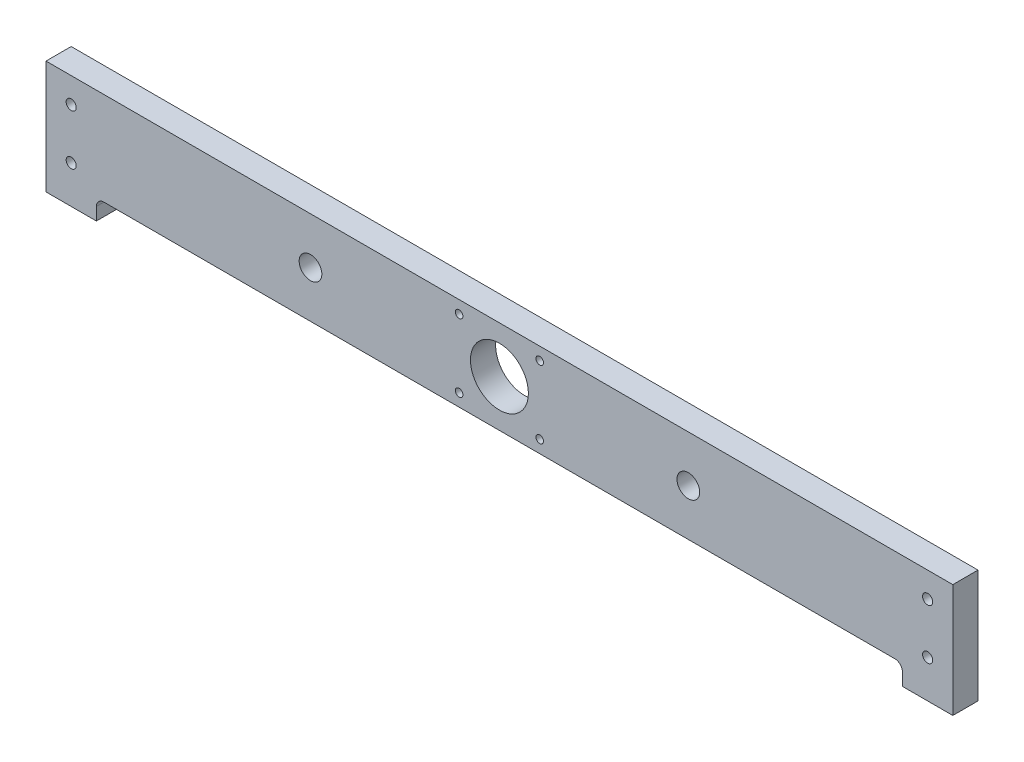
ISO-10303-21;
HEADER;
FILE_DESCRIPTION(('STEP AP214'),'2;1');
FILE_NAME('part.step','',(''),(''),'','','');
FILE_SCHEMA(('AUTOMOTIVE_DESIGN { 1 0 10303 214 1 1 1 1 }'));
ENDSEC;
DATA;
#1=APPLICATION_CONTEXT('core data for automotive mechanical design processes');
#2=APPLICATION_PROTOCOL_DEFINITION('international standard','automotive_design',2000,#1);
#3=PRODUCT_CONTEXT('',#1,'mechanical');
#4=PRODUCT('Part','Part','',(#3));
#5=PRODUCT_RELATED_PRODUCT_CATEGORY('part','',(#4));
#6=PRODUCT_DEFINITION_FORMATION('','',#4);
#7=PRODUCT_DEFINITION_CONTEXT('part definition',#1,'design');
#8=PRODUCT_DEFINITION('design','',#6,#7);
#9=PRODUCT_DEFINITION_SHAPE('','',#8);
#10=(LENGTH_UNIT() NAMED_UNIT(*) SI_UNIT(.MILLI.,.METRE.));
#11=(NAMED_UNIT(*) PLANE_ANGLE_UNIT() SI_UNIT($,.RADIAN.));
#12=(NAMED_UNIT(*) SI_UNIT($,.STERADIAN.) SOLID_ANGLE_UNIT());
#13=UNCERTAINTY_MEASURE_WITH_UNIT(LENGTH_MEASURE(1.E-05),#10,'distance_accuracy_value','');
#14=(GEOMETRIC_REPRESENTATION_CONTEXT(3) GLOBAL_UNCERTAINTY_ASSIGNED_CONTEXT((#13)) GLOBAL_UNIT_ASSIGNED_CONTEXT((#10,
#11,#12)) REPRESENTATION_CONTEXT('',''));
#15=CARTESIAN_POINT('',(0.,0.,0.));
#16=DIRECTION('',(0.,0.,1.));
#17=DIRECTION('',(1.,0.,0.));
#18=AXIS2_PLACEMENT_3D('',#15,#16,#17);
#19=CARTESIAN_POINT('',(23.,-40.,10.));
#20=DIRECTION('',(0.,0.,1.));
#21=DIRECTION('',(1.,0.,0.));
#22=AXIS2_PLACEMENT_3D('',#19,#20,#21);
#23=PLANE('',#22);
#24=CARTESIAN_POINT('',(196.,-32.,10.));
#25=DIRECTION('',(0.,0.,1.));
#26=DIRECTION('',(1.,0.,0.));
#27=AXIS2_PLACEMENT_3D('',#24,#25,#26);
#28=CIRCLE('',#27,1.5);
#29=CARTESIAN_POINT('',(197.5,-32.,10.));
#30=VERTEX_POINT('',#29);
#31=EDGE_CURVE('E313',#30,#30,#28,.T.);
#32=ORIENTED_EDGE('',*,*,#31,.F.);
#33=EDGE_LOOP('',(#32));
#34=FACE_BOUND('',#33,.T.);
#35=CARTESIAN_POINT('',(164.,-5.,10.));
#36=DIRECTION('',(0.,0.,1.));
#37=DIRECTION('',(1.,0.,0.));
#38=AXIS2_PLACEMENT_3D('',#35,#36,#37);
#39=CIRCLE('',#38,1.5);
#40=CARTESIAN_POINT('',(165.5,-5.,10.));
#41=VERTEX_POINT('',#40);
#42=EDGE_CURVE('E297',#41,#41,#39,.T.);
#43=ORIENTED_EDGE('',*,*,#42,.F.);
#44=EDGE_LOOP('',(#43));
#45=FACE_BOUND('',#44,.T.);
#46=CARTESIAN_POINT('',(255.,-18.5,10.));
#47=DIRECTION('',(0.,0.,1.));
#48=DIRECTION('',(1.,0.,0.));
#49=AXIS2_PLACEMENT_3D('',#46,#47,#48);
#50=CIRCLE('',#49,4.50000000000002);
#51=CARTESIAN_POINT('',(259.5,-18.5,10.));
#52=VERTEX_POINT('',#51);
#53=EDGE_CURVE('E281',#52,#52,#50,.T.);
#54=ORIENTED_EDGE('',*,*,#53,.F.);
#55=EDGE_LOOP('',(#54));
#56=FACE_BOUND('',#55,.T.);
#57=CARTESIAN_POINT('',(10.,-30.0044761270958,10.));
#58=DIRECTION('',(0.,0.,1.));
#59=DIRECTION('',(1.,0.,0.));
#60=AXIS2_PLACEMENT_3D('',#57,#58,#59);
#61=CIRCLE('',#60,2.);
#62=CARTESIAN_POINT('',(12.,-30.0044761270958,10.));
#63=VERTEX_POINT('',#62);
#64=EDGE_CURVE('E265',#63,#63,#61,.T.);
#65=ORIENTED_EDGE('',*,*,#64,.F.);
#66=EDGE_LOOP('',(#65));
#67=FACE_BOUND('',#66,.T.);
#68=CARTESIAN_POINT('',(350.,-30.,10.));
#69=DIRECTION('',(0.,0.,1.));
#70=DIRECTION('',(1.,0.,0.));
#71=AXIS2_PLACEMENT_3D('',#68,#69,#70);
#72=CIRCLE('',#71,2.);
#73=CARTESIAN_POINT('',(352.,-30.,10.));
#74=VERTEX_POINT('',#73);
#75=EDGE_CURVE('E249',#74,#74,#72,.T.);
#76=ORIENTED_EDGE('',*,*,#75,.F.);
#77=EDGE_LOOP('',(#76));
#78=FACE_BOUND('',#77,.T.);
#79=DIRECTION('',(0.,-1.,0.));
#80=VECTOR('',#79,1.);
#81=CARTESIAN_POINT('',(0.,0.,10.));
#82=LINE('',#81,#80);
#83=CARTESIAN_POINT('',(0.,0.,10.));
#84=VERTEX_POINT('',#83);
#85=CARTESIAN_POINT('',(0.,-45.,10.));
#86=VERTEX_POINT('',#85);
#87=EDGE_CURVE('E182',#84,#86,#82,.T.);
#88=ORIENTED_EDGE('',*,*,#87,.T.);
#89=DIRECTION('',(1.,0.,0.));
#90=VECTOR('',#89,1.);
#91=CARTESIAN_POINT('',(0.,-45.,10.));
#92=LINE('',#91,#90);
#93=CARTESIAN_POINT('',(20.,-45.,10.));
#94=VERTEX_POINT('',#93);
#95=EDGE_CURVE('E106',#86,#94,#92,.T.);
#96=ORIENTED_EDGE('',*,*,#95,.T.);
#97=DIRECTION('',(0.,1.,0.));
#98=VECTOR('',#97,1.);
#99=CARTESIAN_POINT('',(20.,-45.,10.));
#100=LINE('',#99,#98);
#101=CARTESIAN_POINT('',(20.,-40.,10.));
#102=VERTEX_POINT('',#101);
#103=EDGE_CURVE('E211',#94,#102,#100,.T.);
#104=ORIENTED_EDGE('',*,*,#103,.T.);
#105=CARTESIAN_POINT('',(23.,-40.,10.));
#106=DIRECTION('',(0.,0.,-1.));
#107=DIRECTION('',(1.,0.,0.));
#108=AXIS2_PLACEMENT_3D('',#105,#106,#107);
#109=CIRCLE('',#108,3.);
#110=CARTESIAN_POINT('',(23.,-37.,10.));
#111=VERTEX_POINT('',#110);
#112=EDGE_CURVE('E231',#102,#111,#109,.T.);
#113=ORIENTED_EDGE('',*,*,#112,.T.);
#114=DIRECTION('',(1.,0.,0.));
#115=VECTOR('',#114,1.);
#116=CARTESIAN_POINT('',(23.,-37.,10.));
#117=LINE('',#116,#115);
#118=CARTESIAN_POINT('',(337.,-37.,10.));
#119=VERTEX_POINT('',#118);
#120=EDGE_CURVE('E227',#111,#119,#117,.T.);
#121=ORIENTED_EDGE('',*,*,#120,.T.);
#122=CARTESIAN_POINT('',(337.,-40.,10.));
#123=DIRECTION('',(0.,0.,-1.));
#124=DIRECTION('',(1.,0.,0.));
#125=AXIS2_PLACEMENT_3D('',#122,#123,#124);
#126=CIRCLE('',#125,3.);
#127=CARTESIAN_POINT('',(340.,-40.,10.));
#128=VERTEX_POINT('',#127);
#129=EDGE_CURVE('E230',#119,#128,#126,.T.);
#130=ORIENTED_EDGE('',*,*,#129,.T.);
#131=DIRECTION('',(0.,-1.,0.));
#132=VECTOR('',#131,1.);
#133=CARTESIAN_POINT('',(340.,-45.,10.));
#134=LINE('',#133,#132);
#135=CARTESIAN_POINT('',(340.,-45.,10.));
#136=VERTEX_POINT('',#135);
#137=EDGE_CURVE('E131',#128,#136,#134,.T.);
#138=ORIENTED_EDGE('',*,*,#137,.T.);
#139=DIRECTION('',(1.,0.,0.));
#140=VECTOR('',#139,1.);
#141=CARTESIAN_POINT('',(360.,-45.,10.));
#142=LINE('',#141,#140);
#143=CARTESIAN_POINT('',(360.,-45.,10.));
#144=VERTEX_POINT('',#143);
#145=EDGE_CURVE('E125',#136,#144,#142,.T.);
#146=ORIENTED_EDGE('',*,*,#145,.T.);
#147=DIRECTION('',(0.,1.,0.));
#148=VECTOR('',#147,1.);
#149=CARTESIAN_POINT('',(360.,0.,10.));
#150=LINE('',#149,#148);
#151=CARTESIAN_POINT('',(360.,0.,10.));
#152=VERTEX_POINT('',#151);
#153=EDGE_CURVE('E129',#144,#152,#150,.T.);
#154=ORIENTED_EDGE('',*,*,#153,.T.);
#155=DIRECTION('',(-1.,0.,0.));
#156=VECTOR('',#155,1.);
#157=CARTESIAN_POINT('',(0.,0.,10.));
#158=LINE('',#157,#156);
#159=EDGE_CURVE('E57',#152,#84,#158,.T.);
#160=ORIENTED_EDGE('',*,*,#159,.T.);
#161=EDGE_LOOP('',(#88,#96,#104,#113,#121,#130,#138,#146,#154,#160));
#162=FACE_BOUND('',#161,.T.);
#163=CARTESIAN_POINT('',(350.,-10.,10.));
#164=DIRECTION('',(0.,0.,1.));
#165=DIRECTION('',(1.,0.,0.));
#166=AXIS2_PLACEMENT_3D('',#163,#164,#165);
#167=CIRCLE('',#166,2.);
#168=CARTESIAN_POINT('',(352.,-10.,10.));
#169=VERTEX_POINT('',#168);
#170=EDGE_CURVE('E158',#169,#169,#167,.T.);
#171=ORIENTED_EDGE('',*,*,#170,.F.);
#172=EDGE_LOOP('',(#171));
#173=FACE_BOUND('',#172,.T.);
#174=CARTESIAN_POINT('',(10.,-10.,10.));
#175=DIRECTION('',(0.,0.,1.));
#176=DIRECTION('',(1.,0.,0.));
#177=AXIS2_PLACEMENT_3D('',#174,#175,#176);
#178=CIRCLE('',#177,2.);
#179=CARTESIAN_POINT('',(12.,-10.,10.));
#180=VERTEX_POINT('',#179);
#181=EDGE_CURVE('E257',#180,#180,#178,.T.);
#182=ORIENTED_EDGE('',*,*,#181,.F.);
#183=EDGE_LOOP('',(#182));
#184=FACE_BOUND('',#183,.T.);
#185=CARTESIAN_POINT('',(180.,-18.5,10.));
#186=DIRECTION('',(0.,0.,1.));
#187=DIRECTION('',(1.,0.,0.));
#188=AXIS2_PLACEMENT_3D('',#185,#186,#187);
#189=CIRCLE('',#188,11.5);
#190=CARTESIAN_POINT('',(191.5,-18.5,10.));
#191=VERTEX_POINT('',#190);
#192=EDGE_CURVE('E273',#191,#191,#189,.T.);
#193=ORIENTED_EDGE('',*,*,#192,.F.);
#194=EDGE_LOOP('',(#193));
#195=FACE_BOUND('',#194,.T.);
#196=CARTESIAN_POINT('',(105.,-18.5,10.));
#197=DIRECTION('',(0.,0.,1.));
#198=DIRECTION('',(1.,0.,0.));
#199=AXIS2_PLACEMENT_3D('',#196,#197,#198);
#200=CIRCLE('',#199,4.5);
#201=CARTESIAN_POINT('',(109.5,-18.5,10.));
#202=VERTEX_POINT('',#201);
#203=EDGE_CURVE('E289',#202,#202,#200,.T.);
#204=ORIENTED_EDGE('',*,*,#203,.F.);
#205=EDGE_LOOP('',(#204));
#206=FACE_BOUND('',#205,.T.);
#207=CARTESIAN_POINT('',(196.,-5.,10.));
#208=DIRECTION('',(0.,0.,1.));
#209=DIRECTION('',(1.,0.,0.));
#210=AXIS2_PLACEMENT_3D('',#207,#208,#209);
#211=CIRCLE('',#210,1.5);
#212=CARTESIAN_POINT('',(197.5,-5.,10.));
#213=VERTEX_POINT('',#212);
#214=EDGE_CURVE('E305',#213,#213,#211,.T.);
#215=ORIENTED_EDGE('',*,*,#214,.F.);
#216=EDGE_LOOP('',(#215));
#217=FACE_BOUND('',#216,.T.);
#218=CARTESIAN_POINT('',(164.,-32.,10.));
#219=DIRECTION('',(0.,0.,1.));
#220=DIRECTION('',(1.,0.,0.));
#221=AXIS2_PLACEMENT_3D('',#218,#219,#220);
#222=CIRCLE('',#221,1.5);
#223=CARTESIAN_POINT('',(165.5,-32.,10.));
#224=VERTEX_POINT('',#223);
#225=EDGE_CURVE('E321',#224,#224,#222,.T.);
#226=ORIENTED_EDGE('',*,*,#225,.F.);
#227=EDGE_LOOP('',(#226));
#228=FACE_BOUND('',#227,.T.);
#229=ADVANCED_FACE('F39',(#34,#45,#56,#67,#78,#162,#173,#184,#195,#206,#217,#228),#23,.T.);
#230=CARTESIAN_POINT('',(23.,-40.,0.));
#231=DIRECTION('',(0.,0.,1.));
#232=DIRECTION('',(1.,0.,0.));
#233=AXIS2_PLACEMENT_3D('',#230,#231,#232);
#234=PLANE('',#233);
#235=DIRECTION('',(0.,-1.,0.));
#236=VECTOR('',#235,1.);
#237=CARTESIAN_POINT('',(0.,0.,0.));
#238=LINE('',#237,#236);
#239=CARTESIAN_POINT('',(0.,0.,0.));
#240=VERTEX_POINT('',#239);
#241=CARTESIAN_POINT('',(0.,-45.,0.));
#242=VERTEX_POINT('',#241);
#243=EDGE_CURVE('E153',#240,#242,#238,.T.);
#244=ORIENTED_EDGE('',*,*,#243,.F.);
#245=DIRECTION('',(-1.,0.,0.));
#246=VECTOR('',#245,1.);
#247=CARTESIAN_POINT('',(0.,0.,0.));
#248=LINE('',#247,#246);
#249=CARTESIAN_POINT('',(360.,0.,0.));
#250=VERTEX_POINT('',#249);
#251=EDGE_CURVE('E98',#250,#240,#248,.T.);
#252=ORIENTED_EDGE('',*,*,#251,.F.);
#253=DIRECTION('',(0.,1.,0.));
#254=VECTOR('',#253,1.);
#255=CARTESIAN_POINT('',(360.,0.,0.));
#256=LINE('',#255,#254);
#257=CARTESIAN_POINT('',(360.,-45.,0.));
#258=VERTEX_POINT('',#257);
#259=EDGE_CURVE('E92',#258,#250,#256,.T.);
#260=ORIENTED_EDGE('',*,*,#259,.F.);
#261=DIRECTION('',(1.,0.,0.));
#262=VECTOR('',#261,1.);
#263=CARTESIAN_POINT('',(360.,-45.,0.));
#264=LINE('',#263,#262);
#265=CARTESIAN_POINT('',(340.,-45.,0.));
#266=VERTEX_POINT('',#265);
#267=EDGE_CURVE('E140',#266,#258,#264,.T.);
#268=ORIENTED_EDGE('',*,*,#267,.F.);
#269=DIRECTION('',(0.,-1.,0.));
#270=VECTOR('',#269,1.);
#271=CARTESIAN_POINT('',(340.,-45.,0.));
#272=LINE('',#271,#270);
#273=CARTESIAN_POINT('',(340.,-40.,0.));
#274=VERTEX_POINT('',#273);
#275=EDGE_CURVE('E173',#274,#266,#272,.T.);
#276=ORIENTED_EDGE('',*,*,#275,.F.);
#277=CARTESIAN_POINT('',(337.,-40.,0.));
#278=DIRECTION('',(0.,0.,-1.));
#279=DIRECTION('',(1.,0.,0.));
#280=AXIS2_PLACEMENT_3D('',#277,#278,#279);
#281=CIRCLE('',#280,3.);
#282=CARTESIAN_POINT('',(337.,-37.,0.));
#283=VERTEX_POINT('',#282);
#284=EDGE_CURVE('E170',#283,#274,#281,.T.);
#285=ORIENTED_EDGE('',*,*,#284,.F.);
#286=DIRECTION('',(1.,0.,0.));
#287=VECTOR('',#286,1.);
#288=CARTESIAN_POINT('',(23.,-37.,0.));
#289=LINE('',#288,#287);
#290=CARTESIAN_POINT('',(23.,-37.,0.));
#291=VERTEX_POINT('',#290);
#292=EDGE_CURVE('E167',#291,#283,#289,.T.);
#293=ORIENTED_EDGE('',*,*,#292,.F.);
#294=CARTESIAN_POINT('',(23.,-40.,0.));
#295=DIRECTION('',(0.,0.,-1.));
#296=DIRECTION('',(1.,0.,0.));
#297=AXIS2_PLACEMENT_3D('',#294,#295,#296);
#298=CIRCLE('',#297,3.);
#299=CARTESIAN_POINT('',(20.,-40.,0.));
#300=VERTEX_POINT('',#299);
#301=EDGE_CURVE('E164',#300,#291,#298,.T.);
#302=ORIENTED_EDGE('',*,*,#301,.F.);
#303=DIRECTION('',(0.,1.,0.));
#304=VECTOR('',#303,1.);
#305=CARTESIAN_POINT('',(20.,-45.,0.));
#306=LINE('',#305,#304);
#307=CARTESIAN_POINT('',(20.,-45.,0.));
#308=VERTEX_POINT('',#307);
#309=EDGE_CURVE('E161',#308,#300,#306,.T.);
#310=ORIENTED_EDGE('',*,*,#309,.F.);
#311=DIRECTION('',(1.,0.,0.));
#312=VECTOR('',#311,1.);
#313=CARTESIAN_POINT('',(0.,-45.,0.));
#314=LINE('',#313,#312);
#315=EDGE_CURVE('E157',#242,#308,#314,.T.);
#316=ORIENTED_EDGE('',*,*,#315,.F.);
#317=EDGE_LOOP('',(#244,#252,#260,#268,#276,#285,#293,#302,#310,#316));
#318=FACE_BOUND('',#317,.T.);
#319=CARTESIAN_POINT('',(350.,-10.,0.));
#320=DIRECTION('',(0.,0.,1.));
#321=DIRECTION('',(1.,0.,0.));
#322=AXIS2_PLACEMENT_3D('',#319,#320,#321);
#323=CIRCLE('',#322,2.);
#324=CARTESIAN_POINT('',(352.,-10.,0.));
#325=VERTEX_POINT('',#324);
#326=EDGE_CURVE('E245',#325,#325,#323,.T.);
#327=ORIENTED_EDGE('',*,*,#326,.T.);
#328=EDGE_LOOP('',(#327));
#329=FACE_BOUND('',#328,.T.);
#330=CARTESIAN_POINT('',(350.,-30.,0.));
#331=DIRECTION('',(0.,0.,1.));
#332=DIRECTION('',(1.,0.,0.));
#333=AXIS2_PLACEMENT_3D('',#330,#331,#332);
#334=CIRCLE('',#333,2.);
#335=CARTESIAN_POINT('',(352.,-30.,0.));
#336=VERTEX_POINT('',#335);
#337=EDGE_CURVE('E253',#336,#336,#334,.T.);
#338=ORIENTED_EDGE('',*,*,#337,.T.);
#339=EDGE_LOOP('',(#338));
#340=FACE_BOUND('',#339,.T.);
#341=CARTESIAN_POINT('',(10.,-10.,0.));
#342=DIRECTION('',(0.,0.,1.));
#343=DIRECTION('',(1.,0.,0.));
#344=AXIS2_PLACEMENT_3D('',#341,#342,#343);
#345=CIRCLE('',#344,2.);
#346=CARTESIAN_POINT('',(12.,-10.,0.));
#347=VERTEX_POINT('',#346);
#348=EDGE_CURVE('E261',#347,#347,#345,.T.);
#349=ORIENTED_EDGE('',*,*,#348,.T.);
#350=EDGE_LOOP('',(#349));
#351=FACE_BOUND('',#350,.T.);
#352=CARTESIAN_POINT('',(10.,-30.0044761270958,0.));
#353=DIRECTION('',(0.,0.,1.));
#354=DIRECTION('',(1.,0.,0.));
#355=AXIS2_PLACEMENT_3D('',#352,#353,#354);
#356=CIRCLE('',#355,2.);
#357=CARTESIAN_POINT('',(12.,-30.0044761270958,0.));
#358=VERTEX_POINT('',#357);
#359=EDGE_CURVE('E269',#358,#358,#356,.T.);
#360=ORIENTED_EDGE('',*,*,#359,.T.);
#361=EDGE_LOOP('',(#360));
#362=FACE_BOUND('',#361,.T.);
#363=CARTESIAN_POINT('',(180.,-18.5,0.));
#364=DIRECTION('',(0.,0.,1.));
#365=DIRECTION('',(1.,0.,0.));
#366=AXIS2_PLACEMENT_3D('',#363,#364,#365);
#367=CIRCLE('',#366,11.5);
#368=CARTESIAN_POINT('',(191.5,-18.5,0.));
#369=VERTEX_POINT('',#368);
#370=EDGE_CURVE('E277',#369,#369,#367,.T.);
#371=ORIENTED_EDGE('',*,*,#370,.T.);
#372=EDGE_LOOP('',(#371));
#373=FACE_BOUND('',#372,.T.);
#374=CARTESIAN_POINT('',(255.,-18.5,0.));
#375=DIRECTION('',(0.,0.,1.));
#376=DIRECTION('',(1.,0.,0.));
#377=AXIS2_PLACEMENT_3D('',#374,#375,#376);
#378=CIRCLE('',#377,4.50000000000002);
#379=CARTESIAN_POINT('',(259.5,-18.5,0.));
#380=VERTEX_POINT('',#379);
#381=EDGE_CURVE('E285',#380,#380,#378,.T.);
#382=ORIENTED_EDGE('',*,*,#381,.T.);
#383=EDGE_LOOP('',(#382));
#384=FACE_BOUND('',#383,.T.);
#385=CARTESIAN_POINT('',(105.,-18.5,0.));
#386=DIRECTION('',(0.,0.,1.));
#387=DIRECTION('',(1.,0.,0.));
#388=AXIS2_PLACEMENT_3D('',#385,#386,#387);
#389=CIRCLE('',#388,4.5);
#390=CARTESIAN_POINT('',(109.5,-18.5,0.));
#391=VERTEX_POINT('',#390);
#392=EDGE_CURVE('E293',#391,#391,#389,.T.);
#393=ORIENTED_EDGE('',*,*,#392,.T.);
#394=EDGE_LOOP('',(#393));
#395=FACE_BOUND('',#394,.T.);
#396=CARTESIAN_POINT('',(164.,-5.,0.));
#397=DIRECTION('',(0.,0.,1.));
#398=DIRECTION('',(1.,0.,0.));
#399=AXIS2_PLACEMENT_3D('',#396,#397,#398);
#400=CIRCLE('',#399,1.5);
#401=CARTESIAN_POINT('',(165.5,-5.,0.));
#402=VERTEX_POINT('',#401);
#403=EDGE_CURVE('E301',#402,#402,#400,.T.);
#404=ORIENTED_EDGE('',*,*,#403,.T.);
#405=EDGE_LOOP('',(#404));
#406=FACE_BOUND('',#405,.T.);
#407=CARTESIAN_POINT('',(196.,-5.,0.));
#408=DIRECTION('',(0.,0.,1.));
#409=DIRECTION('',(1.,0.,0.));
#410=AXIS2_PLACEMENT_3D('',#407,#408,#409);
#411=CIRCLE('',#410,1.5);
#412=CARTESIAN_POINT('',(197.5,-5.,0.));
#413=VERTEX_POINT('',#412);
#414=EDGE_CURVE('E309',#413,#413,#411,.T.);
#415=ORIENTED_EDGE('',*,*,#414,.T.);
#416=EDGE_LOOP('',(#415));
#417=FACE_BOUND('',#416,.T.);
#418=CARTESIAN_POINT('',(196.,-32.,0.));
#419=DIRECTION('',(0.,0.,1.));
#420=DIRECTION('',(1.,0.,0.));
#421=AXIS2_PLACEMENT_3D('',#418,#419,#420);
#422=CIRCLE('',#421,1.5);
#423=CARTESIAN_POINT('',(197.5,-32.,0.));
#424=VERTEX_POINT('',#423);
#425=EDGE_CURVE('E317',#424,#424,#422,.T.);
#426=ORIENTED_EDGE('',*,*,#425,.T.);
#427=EDGE_LOOP('',(#426));
#428=FACE_BOUND('',#427,.T.);
#429=CARTESIAN_POINT('',(164.,-32.,0.));
#430=DIRECTION('',(0.,0.,1.));
#431=DIRECTION('',(1.,0.,0.));
#432=AXIS2_PLACEMENT_3D('',#429,#430,#431);
#433=CIRCLE('',#432,1.5);
#434=CARTESIAN_POINT('',(165.5,-32.,0.));
#435=VERTEX_POINT('',#434);
#436=EDGE_CURVE('E325',#435,#435,#433,.T.);
#437=ORIENTED_EDGE('',*,*,#436,.T.);
#438=EDGE_LOOP('',(#437));
#439=FACE_BOUND('',#438,.T.);
#440=ADVANCED_FACE('F215',(#318,#329,#340,#351,#362,#373,#384,#395,#406,#417,#428,#439),#234,.F.);
#441=CARTESIAN_POINT('',(0.,0.,10.));
#442=DIRECTION('',(1.,0.,0.));
#443=DIRECTION('',(0.,1.,0.));
#444=AXIS2_PLACEMENT_3D('',#441,#442,#443);
#445=PLANE('',#444);
#446=ORIENTED_EDGE('',*,*,#243,.T.);
#447=DIRECTION('',(0.,0.,-1.));
#448=VECTOR('',#447,1.);
#449=CARTESIAN_POINT('',(0.,-45.,10.));
#450=LINE('',#449,#448);
#451=EDGE_CURVE('E11',#86,#242,#450,.T.);
#452=ORIENTED_EDGE('',*,*,#451,.F.);
#453=ORIENTED_EDGE('',*,*,#87,.F.);
#454=DIRECTION('',(0.,0.,-1.));
#455=VECTOR('',#454,1.);
#456=CARTESIAN_POINT('',(0.,0.,10.));
#457=LINE('',#456,#455);
#458=EDGE_CURVE('E149',#84,#240,#457,.T.);
#459=ORIENTED_EDGE('',*,*,#458,.T.);
#460=EDGE_LOOP('',(#446,#452,#453,#459));
#461=FACE_BOUND('',#460,.T.);
#462=ADVANCED_FACE('F41',(#461),#445,.F.);
#463=CARTESIAN_POINT('',(0.,-45.,10.));
#464=DIRECTION('',(0.,1.,0.));
#465=DIRECTION('',(0.,0.,1.));
#466=AXIS2_PLACEMENT_3D('',#463,#464,#465);
#467=PLANE('',#466);
#468=ORIENTED_EDGE('',*,*,#315,.T.);
#469=DIRECTION('',(0.,0.,-1.));
#470=VECTOR('',#469,1.);
#471=CARTESIAN_POINT('',(20.,-45.,10.));
#472=LINE('',#471,#470);
#473=EDGE_CURVE('E49',#94,#308,#472,.T.);
#474=ORIENTED_EDGE('',*,*,#473,.F.);
#475=ORIENTED_EDGE('',*,*,#95,.F.);
#476=ORIENTED_EDGE('',*,*,#451,.T.);
#477=EDGE_LOOP('',(#468,#474,#475,#476));
#478=FACE_BOUND('',#477,.T.);
#479=ADVANCED_FACE('F369',(#478),#467,.F.);
#480=CARTESIAN_POINT('',(20.,-45.,10.));
#481=DIRECTION('',(-1.,0.,0.));
#482=DIRECTION('',(0.,0.,1.));
#483=AXIS2_PLACEMENT_3D('',#480,#481,#482);
#484=PLANE('',#483);
#485=ORIENTED_EDGE('',*,*,#309,.T.);
#486=DIRECTION('',(0.,0.,-1.));
#487=VECTOR('',#486,1.);
#488=CARTESIAN_POINT('',(20.,-40.,10.));
#489=LINE('',#488,#487);
#490=EDGE_CURVE('E201',#102,#300,#489,.T.);
#491=ORIENTED_EDGE('',*,*,#490,.F.);
#492=ORIENTED_EDGE('',*,*,#103,.F.);
#493=ORIENTED_EDGE('',*,*,#473,.T.);
#494=EDGE_LOOP('',(#485,#491,#492,#493));
#495=FACE_BOUND('',#494,.T.);
#496=ADVANCED_FACE('F209',(#495),#484,.F.);
#497=CARTESIAN_POINT('',(23.,-40.,10.));
#498=DIRECTION('',(0.,0.,-1.));
#499=DIRECTION('',(-1.,0.,0.));
#500=AXIS2_PLACEMENT_3D('',#497,#498,#499);
#501=CYLINDRICAL_SURFACE('',#500,3.);
#502=ORIENTED_EDGE('',*,*,#301,.T.);
#503=DIRECTION('',(0.,0.,-1.));
#504=VECTOR('',#503,1.);
#505=CARTESIAN_POINT('',(23.,-37.,10.));
#506=LINE('',#505,#504);
#507=EDGE_CURVE('E197',#111,#291,#506,.T.);
#508=ORIENTED_EDGE('',*,*,#507,.F.);
#509=ORIENTED_EDGE('',*,*,#112,.F.);
#510=ORIENTED_EDGE('',*,*,#490,.T.);
#511=EDGE_LOOP('',(#502,#508,#509,#510));
#512=FACE_BOUND('',#511,.T.);
#513=ADVANCED_FACE('F221',(#512),#501,.F.);
#514=CARTESIAN_POINT('',(23.,-37.,10.));
#515=DIRECTION('',(0.,1.,0.));
#516=DIRECTION('',(0.,0.,1.));
#517=AXIS2_PLACEMENT_3D('',#514,#515,#516);
#518=PLANE('',#517);
#519=ORIENTED_EDGE('',*,*,#292,.T.);
#520=DIRECTION('',(0.,0.,-1.));
#521=VECTOR('',#520,1.);
#522=CARTESIAN_POINT('',(337.,-37.,10.));
#523=LINE('',#522,#521);
#524=EDGE_CURVE('E193',#119,#283,#523,.T.);
#525=ORIENTED_EDGE('',*,*,#524,.F.);
#526=ORIENTED_EDGE('',*,*,#120,.F.);
#527=ORIENTED_EDGE('',*,*,#507,.T.);
#528=EDGE_LOOP('',(#519,#525,#526,#527));
#529=FACE_BOUND('',#528,.T.);
#530=ADVANCED_FACE('F225',(#529),#518,.F.);
#531=CARTESIAN_POINT('',(337.,-40.,10.));
#532=DIRECTION('',(0.,0.,-1.));
#533=DIRECTION('',(-1.,0.,0.));
#534=AXIS2_PLACEMENT_3D('',#531,#532,#533);
#535=CYLINDRICAL_SURFACE('',#534,3.);
#536=ORIENTED_EDGE('',*,*,#284,.T.);
#537=DIRECTION('',(0.,0.,-1.));
#538=VECTOR('',#537,1.);
#539=CARTESIAN_POINT('',(340.,-40.,10.));
#540=LINE('',#539,#538);
#541=EDGE_CURVE('E189',#128,#274,#540,.T.);
#542=ORIENTED_EDGE('',*,*,#541,.F.);
#543=ORIENTED_EDGE('',*,*,#129,.F.);
#544=ORIENTED_EDGE('',*,*,#524,.T.);
#545=EDGE_LOOP('',(#536,#542,#543,#544));
#546=FACE_BOUND('',#545,.T.);
#547=ADVANCED_FACE('F359',(#546),#535,.F.);
#548=CARTESIAN_POINT('',(340.,-45.,10.));
#549=DIRECTION('',(1.,0.,0.));
#550=DIRECTION('',(0.,0.,-1.));
#551=AXIS2_PLACEMENT_3D('',#548,#549,#550);
#552=PLANE('',#551);
#553=ORIENTED_EDGE('',*,*,#275,.T.);
#554=DIRECTION('',(0.,0.,-1.));
#555=VECTOR('',#554,1.);
#556=CARTESIAN_POINT('',(340.,-45.,10.));
#557=LINE('',#556,#555);
#558=EDGE_CURVE('E142',#136,#266,#557,.T.);
#559=ORIENTED_EDGE('',*,*,#558,.F.);
#560=ORIENTED_EDGE('',*,*,#137,.F.);
#561=ORIENTED_EDGE('',*,*,#541,.T.);
#562=EDGE_LOOP('',(#553,#559,#560,#561));
#563=FACE_BOUND('',#562,.T.);
#564=ADVANCED_FACE('F356',(#563),#552,.F.);
#565=CARTESIAN_POINT('',(360.,-45.,10.));
#566=DIRECTION('',(0.,1.,0.));
#567=DIRECTION('',(-1.,0.,0.));
#568=AXIS2_PLACEMENT_3D('',#565,#566,#567);
#569=PLANE('',#568);
#570=ORIENTED_EDGE('',*,*,#267,.T.);
#571=DIRECTION('',(0.,0.,-1.));
#572=VECTOR('',#571,1.);
#573=CARTESIAN_POINT('',(360.,-45.,10.));
#574=LINE('',#573,#572);
#575=EDGE_CURVE('E137',#144,#258,#574,.T.);
#576=ORIENTED_EDGE('',*,*,#575,.F.);
#577=ORIENTED_EDGE('',*,*,#145,.F.);
#578=ORIENTED_EDGE('',*,*,#558,.T.);
#579=EDGE_LOOP('',(#570,#576,#577,#578));
#580=FACE_BOUND('',#579,.T.);
#581=ADVANCED_FACE('F138',(#580),#569,.F.);
#582=CARTESIAN_POINT('',(360.,0.,10.));
#583=DIRECTION('',(-1.,0.,0.));
#584=DIRECTION('',(0.,0.,1.));
#585=AXIS2_PLACEMENT_3D('',#582,#583,#584);
#586=PLANE('',#585);
#587=ORIENTED_EDGE('',*,*,#259,.T.);
#588=DIRECTION('',(0.,0.,-1.));
#589=VECTOR('',#588,1.);
#590=CARTESIAN_POINT('',(360.,0.,10.));
#591=LINE('',#590,#589);
#592=EDGE_CURVE('E143',#152,#250,#591,.T.);
#593=ORIENTED_EDGE('',*,*,#592,.F.);
#594=ORIENTED_EDGE('',*,*,#153,.F.);
#595=ORIENTED_EDGE('',*,*,#575,.T.);
#596=EDGE_LOOP('',(#587,#593,#594,#595));
#597=FACE_BOUND('',#596,.T.);
#598=ADVANCED_FACE('F145',(#597),#586,.F.);
#599=CARTESIAN_POINT('',(0.,0.,10.));
#600=DIRECTION('',(0.,-1.,0.));
#601=DIRECTION('',(0.,0.,-1.));
#602=AXIS2_PLACEMENT_3D('',#599,#600,#601);
#603=PLANE('',#602);
#604=ORIENTED_EDGE('',*,*,#251,.T.);
#605=ORIENTED_EDGE('',*,*,#458,.F.);
#606=ORIENTED_EDGE('',*,*,#159,.F.);
#607=ORIENTED_EDGE('',*,*,#592,.T.);
#608=EDGE_LOOP('',(#604,#605,#606,#607));
#609=FACE_BOUND('',#608,.T.);
#610=ADVANCED_FACE('F349',(#609),#603,.F.);
#611=CARTESIAN_POINT('',(350.,-10.,10.));
#612=DIRECTION('',(0.,0.,-1.));
#613=DIRECTION('',(-1.,0.,0.));
#614=AXIS2_PLACEMENT_3D('',#611,#612,#613);
#615=CYLINDRICAL_SURFACE('',#614,2.);
#616=ORIENTED_EDGE('',*,*,#170,.T.);
#617=EDGE_LOOP('',(#616));
#618=FACE_BOUND('',#617,.T.);
#619=ORIENTED_EDGE('',*,*,#326,.F.);
#620=EDGE_LOOP('',(#619));
#621=FACE_BOUND('',#620,.T.);
#622=ADVANCED_FACE('F346',(#618,#621),#615,.F.);
#623=CARTESIAN_POINT('',(350.,-30.,10.));
#624=DIRECTION('',(0.,0.,-1.));
#625=DIRECTION('',(-1.,0.,0.));
#626=AXIS2_PLACEMENT_3D('',#623,#624,#625);
#627=CYLINDRICAL_SURFACE('',#626,2.);
#628=ORIENTED_EDGE('',*,*,#75,.T.);
#629=EDGE_LOOP('',(#628));
#630=FACE_BOUND('',#629,.T.);
#631=ORIENTED_EDGE('',*,*,#337,.F.);
#632=EDGE_LOOP('',(#631));
#633=FACE_BOUND('',#632,.T.);
#634=ADVANCED_FACE('F445',(#630,#633),#627,.F.);
#635=CARTESIAN_POINT('',(10.,-10.,10.));
#636=DIRECTION('',(0.,0.,-1.));
#637=DIRECTION('',(-1.,0.,0.));
#638=AXIS2_PLACEMENT_3D('',#635,#636,#637);
#639=CYLINDRICAL_SURFACE('',#638,2.);
#640=ORIENTED_EDGE('',*,*,#181,.T.);
#641=EDGE_LOOP('',(#640));
#642=FACE_BOUND('',#641,.T.);
#643=ORIENTED_EDGE('',*,*,#348,.F.);
#644=EDGE_LOOP('',(#643));
#645=FACE_BOUND('',#644,.T.);
#646=ADVANCED_FACE('F453',(#642,#645),#639,.F.);
#647=CARTESIAN_POINT('',(10.,-30.0044761270958,10.));
#648=DIRECTION('',(0.,0.,-1.));
#649=DIRECTION('',(-1.,0.,0.));
#650=AXIS2_PLACEMENT_3D('',#647,#648,#649);
#651=CYLINDRICAL_SURFACE('',#650,2.);
#652=ORIENTED_EDGE('',*,*,#64,.T.);
#653=EDGE_LOOP('',(#652));
#654=FACE_BOUND('',#653,.T.);
#655=ORIENTED_EDGE('',*,*,#359,.F.);
#656=EDGE_LOOP('',(#655));
#657=FACE_BOUND('',#656,.T.);
#658=ADVANCED_FACE('F461',(#654,#657),#651,.F.);
#659=CARTESIAN_POINT('',(180.,-18.5,10.));
#660=DIRECTION('',(0.,0.,-1.));
#661=DIRECTION('',(-1.,0.,0.));
#662=AXIS2_PLACEMENT_3D('',#659,#660,#661);
#663=CYLINDRICAL_SURFACE('',#662,11.5);
#664=ORIENTED_EDGE('',*,*,#192,.T.);
#665=EDGE_LOOP('',(#664));
#666=FACE_BOUND('',#665,.T.);
#667=ORIENTED_EDGE('',*,*,#370,.F.);
#668=EDGE_LOOP('',(#667));
#669=FACE_BOUND('',#668,.T.);
#670=ADVANCED_FACE('F470',(#666,#669),#663,.F.);
#671=CARTESIAN_POINT('',(255.,-18.5,10.));
#672=DIRECTION('',(0.,0.,-1.));
#673=DIRECTION('',(-1.,0.,0.));
#674=AXIS2_PLACEMENT_3D('',#671,#672,#673);
#675=CYLINDRICAL_SURFACE('',#674,4.50000000000002);
#676=ORIENTED_EDGE('',*,*,#53,.T.);
#677=EDGE_LOOP('',(#676));
#678=FACE_BOUND('',#677,.T.);
#679=ORIENTED_EDGE('',*,*,#381,.F.);
#680=EDGE_LOOP('',(#679));
#681=FACE_BOUND('',#680,.T.);
#682=ADVANCED_FACE('F479',(#678,#681),#675,.F.);
#683=CARTESIAN_POINT('',(105.,-18.5,10.));
#684=DIRECTION('',(0.,0.,-1.));
#685=DIRECTION('',(-1.,0.,0.));
#686=AXIS2_PLACEMENT_3D('',#683,#684,#685);
#687=CYLINDRICAL_SURFACE('',#686,4.5);
#688=ORIENTED_EDGE('',*,*,#203,.T.);
#689=EDGE_LOOP('',(#688));
#690=FACE_BOUND('',#689,.T.);
#691=ORIENTED_EDGE('',*,*,#392,.F.);
#692=EDGE_LOOP('',(#691));
#693=FACE_BOUND('',#692,.T.);
#694=ADVANCED_FACE('F488',(#690,#693),#687,.F.);
#695=CARTESIAN_POINT('',(164.,-5.,10.));
#696=DIRECTION('',(0.,0.,-1.));
#697=DIRECTION('',(-1.,0.,0.));
#698=AXIS2_PLACEMENT_3D('',#695,#696,#697);
#699=CYLINDRICAL_SURFACE('',#698,1.5);
#700=ORIENTED_EDGE('',*,*,#42,.T.);
#701=EDGE_LOOP('',(#700));
#702=FACE_BOUND('',#701,.T.);
#703=ORIENTED_EDGE('',*,*,#403,.F.);
#704=EDGE_LOOP('',(#703));
#705=FACE_BOUND('',#704,.T.);
#706=ADVANCED_FACE('F497',(#702,#705),#699,.F.);
#707=CARTESIAN_POINT('',(196.,-5.,10.));
#708=DIRECTION('',(0.,0.,-1.));
#709=DIRECTION('',(-1.,0.,0.));
#710=AXIS2_PLACEMENT_3D('',#707,#708,#709);
#711=CYLINDRICAL_SURFACE('',#710,1.5);
#712=ORIENTED_EDGE('',*,*,#214,.T.);
#713=EDGE_LOOP('',(#712));
#714=FACE_BOUND('',#713,.T.);
#715=ORIENTED_EDGE('',*,*,#414,.F.);
#716=EDGE_LOOP('',(#715));
#717=FACE_BOUND('',#716,.T.);
#718=ADVANCED_FACE('F506',(#714,#717),#711,.F.);
#719=CARTESIAN_POINT('',(196.,-32.,10.));
#720=DIRECTION('',(0.,0.,-1.));
#721=DIRECTION('',(-1.,0.,0.));
#722=AXIS2_PLACEMENT_3D('',#719,#720,#721);
#723=CYLINDRICAL_SURFACE('',#722,1.5);
#724=ORIENTED_EDGE('',*,*,#31,.T.);
#725=EDGE_LOOP('',(#724));
#726=FACE_BOUND('',#725,.T.);
#727=ORIENTED_EDGE('',*,*,#425,.F.);
#728=EDGE_LOOP('',(#727));
#729=FACE_BOUND('',#728,.T.);
#730=ADVANCED_FACE('F515',(#726,#729),#723,.F.);
#731=CARTESIAN_POINT('',(164.,-32.,10.));
#732=DIRECTION('',(0.,0.,-1.));
#733=DIRECTION('',(-1.,0.,0.));
#734=AXIS2_PLACEMENT_3D('',#731,#732,#733);
#735=CYLINDRICAL_SURFACE('',#734,1.5);
#736=ORIENTED_EDGE('',*,*,#225,.T.);
#737=EDGE_LOOP('',(#736));
#738=FACE_BOUND('',#737,.T.);
#739=ORIENTED_EDGE('',*,*,#436,.F.);
#740=EDGE_LOOP('',(#739));
#741=FACE_BOUND('',#740,.T.);
#742=ADVANCED_FACE('F333',(#738,#741),#735,.F.);
#743=CLOSED_SHELL('',(#229,#440,#462,#479,#496,#513,#530,#547,#564,#581,#598,#610,#622,#634,
#646,#658,#670,#682,#694,#706,#718,#730,#742));
#744=MANIFOLD_SOLID_BREP('B2',#743);
#745=ADVANCED_BREP_SHAPE_REPRESENTATION('',(#18,#744),#14);
#746=SHAPE_DEFINITION_REPRESENTATION(#9,#745);
ENDSEC;
END-ISO-10303-21;
